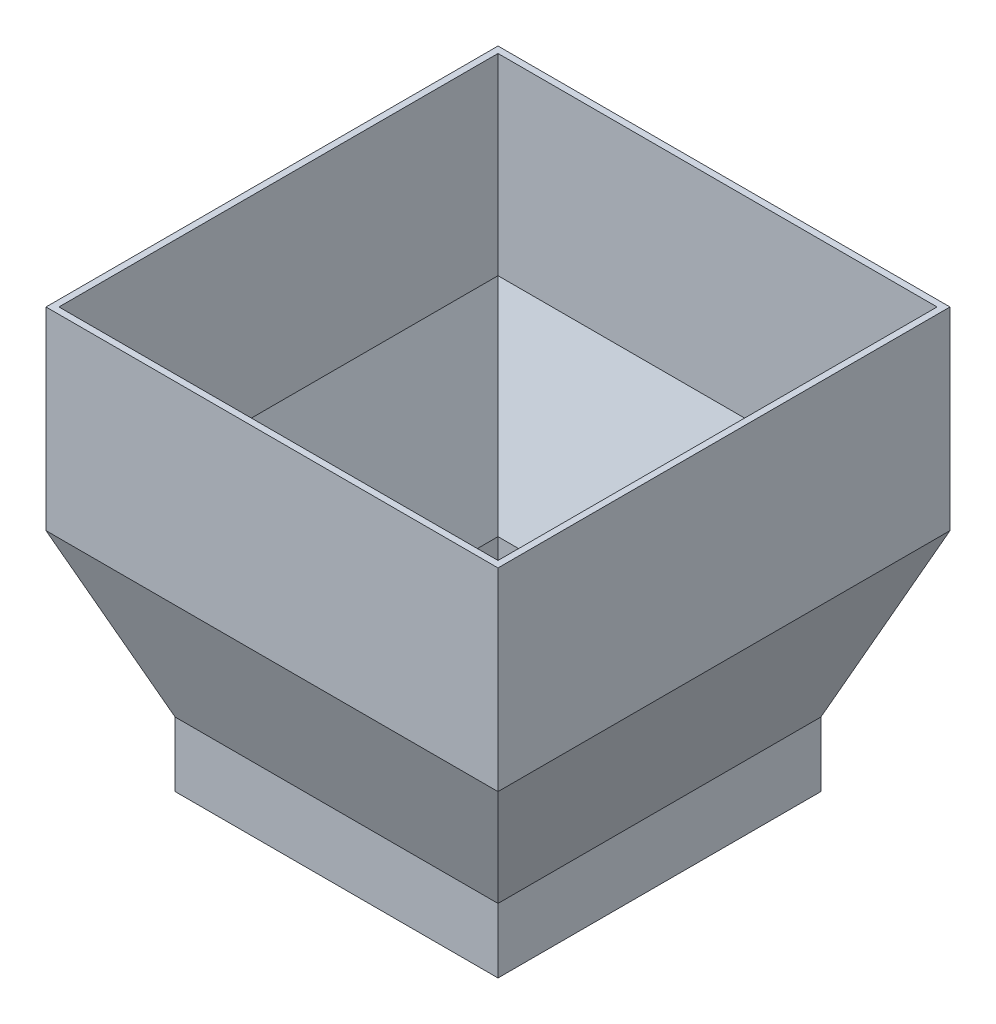
ISO-10303-21;
HEADER;
FILE_DESCRIPTION(('STEP AP214'),'2;1');
FILE_NAME('part.step','',(''),(''),'','','');
FILE_SCHEMA(('AUTOMOTIVE_DESIGN { 1 0 10303 214 1 1 1 1 }'));
ENDSEC;
DATA;
#1=APPLICATION_CONTEXT('core data for automotive mechanical design processes');
#2=APPLICATION_PROTOCOL_DEFINITION('international standard','automotive_design',2000,#1);
#3=PRODUCT_CONTEXT('',#1,'mechanical');
#4=PRODUCT('Part','Part','',(#3));
#5=PRODUCT_RELATED_PRODUCT_CATEGORY('part','',(#4));
#6=PRODUCT_DEFINITION_FORMATION('','',#4);
#7=PRODUCT_DEFINITION_CONTEXT('part definition',#1,'design');
#8=PRODUCT_DEFINITION('design','',#6,#7);
#9=PRODUCT_DEFINITION_SHAPE('','',#8);
#10=(LENGTH_UNIT() NAMED_UNIT(*) SI_UNIT(.MILLI.,.METRE.));
#11=(NAMED_UNIT(*) PLANE_ANGLE_UNIT() SI_UNIT($,.RADIAN.));
#12=(NAMED_UNIT(*) SI_UNIT($,.STERADIAN.) SOLID_ANGLE_UNIT());
#13=UNCERTAINTY_MEASURE_WITH_UNIT(LENGTH_MEASURE(1.E-05),#10,'distance_accuracy_value','');
#14=(GEOMETRIC_REPRESENTATION_CONTEXT(3) GLOBAL_UNCERTAINTY_ASSIGNED_CONTEXT((#13)) GLOBAL_UNIT_ASSIGNED_CONTEXT((#10,
#11,#12)) REPRESENTATION_CONTEXT('',''));
#15=CARTESIAN_POINT('',(0.,0.,0.));
#16=DIRECTION('',(0.,0.,1.));
#17=DIRECTION('',(1.,0.,0.));
#18=AXIS2_PLACEMENT_3D('',#15,#16,#17);
#19=CARTESIAN_POINT('',(350.,300.,-350.));
#20=DIRECTION('',(-1.,0.,0.));
#21=DIRECTION('',(0.,0.,1.));
#22=AXIS2_PLACEMENT_3D('',#19,#20,#21);
#23=PLANE('',#22);
#24=DIRECTION('',(0.,0.,1.));
#25=VECTOR('',#24,1.);
#26=CARTESIAN_POINT('',(350.,0.,-350.));
#27=LINE('',#26,#25);
#28=CARTESIAN_POINT('',(350.,0.,350.));
#29=VERTEX_POINT('',#28);
#30=CARTESIAN_POINT('',(350.,0.,-350.));
#31=VERTEX_POINT('',#30);
#32=EDGE_CURVE('E254',#29,#31,#27,.F.);
#33=ORIENTED_EDGE('',*,*,#32,.T.);
#34=DIRECTION('',(0.,-1.,0.));
#35=VECTOR('',#34,1.);
#36=CARTESIAN_POINT('',(350.,300.,-350.));
#37=LINE('',#36,#35);
#38=CARTESIAN_POINT('',(350.,300.,-350.));
#39=VERTEX_POINT('',#38);
#40=EDGE_CURVE('E12',#39,#31,#37,.T.);
#41=ORIENTED_EDGE('',*,*,#40,.F.);
#42=DIRECTION('',(0.,0.,-1.));
#43=VECTOR('',#42,1.);
#44=CARTESIAN_POINT('',(350.,300.,-350.));
#45=LINE('',#44,#43);
#46=CARTESIAN_POINT('',(350.,300.,350.));
#47=VERTEX_POINT('',#46);
#48=EDGE_CURVE('E434',#47,#39,#45,.T.);
#49=ORIENTED_EDGE('',*,*,#48,.F.);
#50=DIRECTION('',(0.,-1.,0.));
#51=VECTOR('',#50,1.);
#52=CARTESIAN_POINT('',(350.,300.,350.));
#53=LINE('',#52,#51);
#54=EDGE_CURVE('E425',#47,#29,#53,.T.);
#55=ORIENTED_EDGE('',*,*,#54,.T.);
#56=EDGE_LOOP('',(#33,#41,#49,#55));
#57=FACE_BOUND('',#56,.T.);
#58=ADVANCED_FACE('F44',(#57),#23,.F.);
#59=CARTESIAN_POINT('',(-350.,300.,-350.));
#60=DIRECTION('',(0.,0.,1.));
#61=DIRECTION('',(1.,0.,0.));
#62=AXIS2_PLACEMENT_3D('',#59,#60,#61);
#63=PLANE('',#62);
#64=DIRECTION('',(1.,0.,0.));
#65=VECTOR('',#64,1.);
#66=CARTESIAN_POINT('',(-350.,0.,-350.));
#67=LINE('',#66,#65);
#68=CARTESIAN_POINT('',(-350.,0.,-350.));
#69=VERTEX_POINT('',#68);
#70=EDGE_CURVE('E427',#31,#69,#67,.F.);
#71=ORIENTED_EDGE('',*,*,#70,.T.);
#72=DIRECTION('',(0.,-1.,0.));
#73=VECTOR('',#72,1.);
#74=CARTESIAN_POINT('',(-350.,300.,-350.));
#75=LINE('',#74,#73);
#76=CARTESIAN_POINT('',(-350.,300.,-350.));
#77=VERTEX_POINT('',#76);
#78=EDGE_CURVE('E53',#77,#69,#75,.T.);
#79=ORIENTED_EDGE('',*,*,#78,.F.);
#80=DIRECTION('',(-1.,0.,0.));
#81=VECTOR('',#80,1.);
#82=CARTESIAN_POINT('',(-350.,300.,-350.));
#83=LINE('',#82,#81);
#84=EDGE_CURVE('E439',#39,#77,#83,.T.);
#85=ORIENTED_EDGE('',*,*,#84,.F.);
#86=ORIENTED_EDGE('',*,*,#40,.T.);
#87=EDGE_LOOP('',(#71,#79,#85,#86));
#88=FACE_BOUND('',#87,.T.);
#89=ADVANCED_FACE('F413',(#88),#63,.F.);
#90=CARTESIAN_POINT('',(-350.,300.,-350.));
#91=DIRECTION('',(1.,0.,0.));
#92=DIRECTION('',(0.,0.,-1.));
#93=AXIS2_PLACEMENT_3D('',#90,#91,#92);
#94=PLANE('',#93);
#95=DIRECTION('',(0.,0.,-1.));
#96=VECTOR('',#95,1.);
#97=CARTESIAN_POINT('',(-350.,0.,-350.));
#98=LINE('',#97,#96);
#99=CARTESIAN_POINT('',(-350.,0.,350.));
#100=VERTEX_POINT('',#99);
#101=EDGE_CURVE('E398',#69,#100,#98,.F.);
#102=ORIENTED_EDGE('',*,*,#101,.T.);
#103=DIRECTION('',(0.,-1.,0.));
#104=VECTOR('',#103,1.);
#105=CARTESIAN_POINT('',(-350.,300.,350.));
#106=LINE('',#105,#104);
#107=CARTESIAN_POINT('',(-350.,300.,350.));
#108=VERTEX_POINT('',#107);
#109=EDGE_CURVE('E446',#108,#100,#106,.T.);
#110=ORIENTED_EDGE('',*,*,#109,.F.);
#111=DIRECTION('',(0.,0.,1.));
#112=VECTOR('',#111,1.);
#113=CARTESIAN_POINT('',(-350.,300.,-350.));
#114=LINE('',#113,#112);
#115=EDGE_CURVE('E457',#77,#108,#114,.T.);
#116=ORIENTED_EDGE('',*,*,#115,.F.);
#117=ORIENTED_EDGE('',*,*,#78,.T.);
#118=EDGE_LOOP('',(#102,#110,#116,#117));
#119=FACE_BOUND('',#118,.T.);
#120=ADVANCED_FACE('F418',(#119),#94,.F.);
#121=CARTESIAN_POINT('',(-350.,300.,350.));
#122=DIRECTION('',(0.,0.,-1.));
#123=DIRECTION('',(-1.,0.,0.));
#124=AXIS2_PLACEMENT_3D('',#121,#122,#123);
#125=PLANE('',#124);
#126=DIRECTION('',(-1.,0.,0.));
#127=VECTOR('',#126,1.);
#128=CARTESIAN_POINT('',(-350.,0.,350.));
#129=LINE('',#128,#127);
#130=EDGE_CURVE('E432',#100,#29,#129,.F.);
#131=ORIENTED_EDGE('',*,*,#130,.T.);
#132=ORIENTED_EDGE('',*,*,#54,.F.);
#133=DIRECTION('',(1.,0.,0.));
#134=VECTOR('',#133,1.);
#135=CARTESIAN_POINT('',(-350.,300.,350.));
#136=LINE('',#135,#134);
#137=EDGE_CURVE('E452',#108,#47,#136,.T.);
#138=ORIENTED_EDGE('',*,*,#137,.F.);
#139=ORIENTED_EDGE('',*,*,#109,.T.);
#140=EDGE_LOOP('',(#131,#132,#138,#139));
#141=FACE_BOUND('',#140,.T.);
#142=ADVANCED_FACE('F451',(#141),#125,.F.);
#143=CARTESIAN_POINT('',(0.,300.,0.));
#144=DIRECTION('',(0.,1.,0.));
#145=DIRECTION('',(0.,0.,1.));
#146=AXIS2_PLACEMENT_3D('',#143,#144,#145);
#147=PLANE('',#146);
#148=DIRECTION('',(0.,0.,-1.));
#149=VECTOR('',#148,1.);
#150=CARTESIAN_POINT('',(340.,300.,-350.));
#151=LINE('',#150,#149);
#152=CARTESIAN_POINT('',(340.,300.,340.));
#153=VERTEX_POINT('',#152);
#154=CARTESIAN_POINT('',(340.,300.,-340.));
#155=VERTEX_POINT('',#154);
#156=EDGE_CURVE('E188',#153,#155,#151,.T.);
#157=ORIENTED_EDGE('',*,*,#156,.F.);
#158=DIRECTION('',(1.,0.,0.));
#159=VECTOR('',#158,1.);
#160=CARTESIAN_POINT('',(-350.,300.,340.));
#161=LINE('',#160,#159);
#162=CARTESIAN_POINT('',(-340.,300.,340.));
#163=VERTEX_POINT('',#162);
#164=EDGE_CURVE('E193',#163,#153,#161,.T.);
#165=ORIENTED_EDGE('',*,*,#164,.F.);
#166=DIRECTION('',(0.,0.,1.));
#167=VECTOR('',#166,1.);
#168=CARTESIAN_POINT('',(-340.,300.,-350.));
#169=LINE('',#168,#167);
#170=CARTESIAN_POINT('',(-340.,300.,-340.));
#171=VERTEX_POINT('',#170);
#172=EDGE_CURVE('E197',#171,#163,#169,.T.);
#173=ORIENTED_EDGE('',*,*,#172,.F.);
#174=DIRECTION('',(-1.,0.,0.));
#175=VECTOR('',#174,1.);
#176=CARTESIAN_POINT('',(-350.,300.,-340.));
#177=LINE('',#176,#175);
#178=EDGE_CURVE('E231',#155,#171,#177,.T.);
#179=ORIENTED_EDGE('',*,*,#178,.F.);
#180=EDGE_LOOP('',(#157,#165,#173,#179));
#181=FACE_BOUND('',#180,.T.);
#182=ORIENTED_EDGE('',*,*,#48,.T.);
#183=ORIENTED_EDGE('',*,*,#84,.T.);
#184=ORIENTED_EDGE('',*,*,#115,.T.);
#185=ORIENTED_EDGE('',*,*,#137,.T.);
#186=EDGE_LOOP('',(#182,#183,#184,#185));
#187=FACE_BOUND('',#186,.T.);
#188=ADVANCED_FACE('F294',(#181,#187),#147,.T.);
#189=CARTESIAN_POINT('',(0.,-120.689655172414,301.724137931034));
#190=DIRECTION('',(0.,0.371390676354104,-0.928476690885259));
#191=DIRECTION('',(0.,0.928476690885259,0.371390676354104));
#192=AXIS2_PLACEMENT_3D('',#189,#190,#191);
#193=PLANE('',#192);
#194=DIRECTION('',(0.348155311911395,-0.870388279778489,-0.348155311911396));
#195=VECTOR('',#194,1.);
#196=CARTESIAN_POINT('',(-350.,0.,350.));
#197=LINE('',#196,#195);
#198=CARTESIAN_POINT('',(-250.,-250.,250.));
#199=VERTEX_POINT('',#198);
#200=EDGE_CURVE('E264',#100,#199,#197,.T.);
#201=ORIENTED_EDGE('',*,*,#200,.T.);
#202=DIRECTION('',(-1.,0.,0.));
#203=VECTOR('',#202,1.);
#204=CARTESIAN_POINT('',(250.,-250.,250.));
#205=LINE('',#204,#203);
#206=CARTESIAN_POINT('',(250.,-250.,250.));
#207=VERTEX_POINT('',#206);
#208=EDGE_CURVE('E268',#207,#199,#205,.T.);
#209=ORIENTED_EDGE('',*,*,#208,.F.);
#210=DIRECTION('',(-0.348155311911396,-0.870388279778489,-0.348155311911396));
#211=VECTOR('',#210,1.);
#212=CARTESIAN_POINT('',(350.,0.,350.));
#213=LINE('',#212,#211);
#214=EDGE_CURVE('E260',#29,#207,#213,.T.);
#215=ORIENTED_EDGE('',*,*,#214,.F.);
#216=ORIENTED_EDGE('',*,*,#130,.F.);
#217=EDGE_LOOP('',(#201,#209,#215,#216));
#218=FACE_BOUND('',#217,.T.);
#219=ADVANCED_FACE('F283',(#218),#193,.F.);
#220=CARTESIAN_POINT('',(301.724137931034,-120.689655172414,0.));
#221=DIRECTION('',(-0.928476690885259,0.371390676354104,0.));
#222=DIRECTION('',(-0.371390676354104,-0.928476690885259,0.));
#223=AXIS2_PLACEMENT_3D('',#220,#221,#222);
#224=PLANE('',#223);
#225=ORIENTED_EDGE('',*,*,#214,.T.);
#226=DIRECTION('',(0.,0.,1.));
#227=VECTOR('',#226,1.);
#228=CARTESIAN_POINT('',(250.,-250.,250.));
#229=LINE('',#228,#227);
#230=CARTESIAN_POINT('',(250.,-250.,-250.));
#231=VERTEX_POINT('',#230);
#232=EDGE_CURVE('E322',#231,#207,#229,.T.);
#233=ORIENTED_EDGE('',*,*,#232,.F.);
#234=DIRECTION('',(-0.348155311911395,-0.870388279778489,0.348155311911396));
#235=VECTOR('',#234,1.);
#236=CARTESIAN_POINT('',(350.,0.,-350.));
#237=LINE('',#236,#235);
#238=EDGE_CURVE('E251',#31,#231,#237,.T.);
#239=ORIENTED_EDGE('',*,*,#238,.F.);
#240=ORIENTED_EDGE('',*,*,#32,.F.);
#241=EDGE_LOOP('',(#225,#233,#239,#240));
#242=FACE_BOUND('',#241,.T.);
#243=ADVANCED_FACE('F293',(#242),#224,.F.);
#244=CARTESIAN_POINT('',(-301.724137931034,-120.689655172414,0.));
#245=DIRECTION('',(0.928476690885259,0.371390676354104,0.));
#246=DIRECTION('',(-0.371390676354104,0.928476690885259,0.));
#247=AXIS2_PLACEMENT_3D('',#244,#245,#246);
#248=PLANE('',#247);
#249=DIRECTION('',(0.348155311911396,-0.870388279778489,0.348155311911396));
#250=VECTOR('',#249,1.);
#251=CARTESIAN_POINT('',(-350.,0.,-350.));
#252=LINE('',#251,#250);
#253=CARTESIAN_POINT('',(-250.,-250.,-250.));
#254=VERTEX_POINT('',#253);
#255=EDGE_CURVE('E255',#69,#254,#252,.T.);
#256=ORIENTED_EDGE('',*,*,#255,.T.);
#257=DIRECTION('',(0.,0.,-1.));
#258=VECTOR('',#257,1.);
#259=CARTESIAN_POINT('',(-250.,-250.,250.));
#260=LINE('',#259,#258);
#261=EDGE_CURVE('E47',#199,#254,#260,.T.);
#262=ORIENTED_EDGE('',*,*,#261,.F.);
#263=ORIENTED_EDGE('',*,*,#200,.F.);
#264=ORIENTED_EDGE('',*,*,#101,.F.);
#265=EDGE_LOOP('',(#256,#262,#263,#264));
#266=FACE_BOUND('',#265,.T.);
#267=ADVANCED_FACE('F301',(#266),#248,.F.);
#268=CARTESIAN_POINT('',(0.,-120.689655172414,-301.724137931034));
#269=DIRECTION('',(0.,0.371390676354104,0.928476690885259));
#270=DIRECTION('',(0.,-0.928476690885259,0.371390676354104));
#271=AXIS2_PLACEMENT_3D('',#268,#269,#270);
#272=PLANE('',#271);
#273=ORIENTED_EDGE('',*,*,#238,.T.);
#274=DIRECTION('',(1.,0.,0.));
#275=VECTOR('',#274,1.);
#276=CARTESIAN_POINT('',(250.,-250.,-250.));
#277=LINE('',#276,#275);
#278=EDGE_CURVE('E345',#254,#231,#277,.T.);
#279=ORIENTED_EDGE('',*,*,#278,.F.);
#280=ORIENTED_EDGE('',*,*,#255,.F.);
#281=ORIENTED_EDGE('',*,*,#70,.F.);
#282=EDGE_LOOP('',(#273,#279,#280,#281));
#283=FACE_BOUND('',#282,.T.);
#284=ADVANCED_FACE('F463',(#283),#272,.F.);
#285=CARTESIAN_POINT('',(250.,-350.,250.));
#286=DIRECTION('',(-1.,0.,0.));
#287=DIRECTION('',(0.,0.,1.));
#288=AXIS2_PLACEMENT_3D('',#285,#286,#287);
#289=PLANE('',#288);
#290=ORIENTED_EDGE('',*,*,#232,.T.);
#291=DIRECTION('',(0.,1.,0.));
#292=VECTOR('',#291,1.);
#293=CARTESIAN_POINT('',(250.,-350.,250.));
#294=LINE('',#293,#292);
#295=CARTESIAN_POINT('',(250.,-350.,250.));
#296=VERTEX_POINT('',#295);
#297=EDGE_CURVE('E326',#296,#207,#294,.T.);
#298=ORIENTED_EDGE('',*,*,#297,.F.);
#299=DIRECTION('',(0.,0.,1.));
#300=VECTOR('',#299,1.);
#301=CARTESIAN_POINT('',(250.,-350.,250.));
#302=LINE('',#301,#300);
#303=CARTESIAN_POINT('',(250.,-350.,-250.));
#304=VERTEX_POINT('',#303);
#305=EDGE_CURVE('E241',#304,#296,#302,.T.);
#306=ORIENTED_EDGE('',*,*,#305,.F.);
#307=DIRECTION('',(0.,1.,0.));
#308=VECTOR('',#307,1.);
#309=CARTESIAN_POINT('',(250.,-350.,-250.));
#310=LINE('',#309,#308);
#311=EDGE_CURVE('E250',#304,#231,#310,.T.);
#312=ORIENTED_EDGE('',*,*,#311,.T.);
#313=EDGE_LOOP('',(#290,#298,#306,#312));
#314=FACE_BOUND('',#313,.T.);
#315=ADVANCED_FACE('F295',(#314),#289,.F.);
#316=CARTESIAN_POINT('',(-250.,-350.,250.));
#317=DIRECTION('',(0.,0.,-1.));
#318=DIRECTION('',(-1.,0.,0.));
#319=AXIS2_PLACEMENT_3D('',#316,#317,#318);
#320=PLANE('',#319);
#321=ORIENTED_EDGE('',*,*,#208,.T.);
#322=DIRECTION('',(0.,1.,0.));
#323=VECTOR('',#322,1.);
#324=CARTESIAN_POINT('',(-250.,-350.,250.));
#325=LINE('',#324,#323);
#326=CARTESIAN_POINT('',(-250.,-350.,250.));
#327=VERTEX_POINT('',#326);
#328=EDGE_CURVE('E328',#327,#199,#325,.T.);
#329=ORIENTED_EDGE('',*,*,#328,.F.);
#330=DIRECTION('',(-1.,0.,0.));
#331=VECTOR('',#330,1.);
#332=CARTESIAN_POINT('',(-250.,-350.,250.));
#333=LINE('',#332,#331);
#334=EDGE_CURVE('E244',#296,#327,#333,.T.);
#335=ORIENTED_EDGE('',*,*,#334,.F.);
#336=ORIENTED_EDGE('',*,*,#297,.T.);
#337=EDGE_LOOP('',(#321,#329,#335,#336));
#338=FACE_BOUND('',#337,.T.);
#339=ADVANCED_FACE('F376',(#338),#320,.F.);
#340=CARTESIAN_POINT('',(-250.,-350.,250.));
#341=DIRECTION('',(1.,0.,0.));
#342=DIRECTION('',(0.,0.,-1.));
#343=AXIS2_PLACEMENT_3D('',#340,#341,#342);
#344=PLANE('',#343);
#345=ORIENTED_EDGE('',*,*,#261,.T.);
#346=DIRECTION('',(0.,1.,0.));
#347=VECTOR('',#346,1.);
#348=CARTESIAN_POINT('',(-250.,-350.,-250.));
#349=LINE('',#348,#347);
#350=CARTESIAN_POINT('',(-250.,-350.,-250.));
#351=VERTEX_POINT('',#350);
#352=EDGE_CURVE('E347',#351,#254,#349,.T.);
#353=ORIENTED_EDGE('',*,*,#352,.F.);
#354=DIRECTION('',(0.,0.,-1.));
#355=VECTOR('',#354,1.);
#356=CARTESIAN_POINT('',(-250.,-350.,250.));
#357=LINE('',#356,#355);
#358=EDGE_CURVE('E246',#327,#351,#357,.T.);
#359=ORIENTED_EDGE('',*,*,#358,.F.);
#360=ORIENTED_EDGE('',*,*,#328,.T.);
#361=EDGE_LOOP('',(#345,#353,#359,#360));
#362=FACE_BOUND('',#361,.T.);
#363=ADVANCED_FACE('F372',(#362),#344,.F.);
#364=CARTESIAN_POINT('',(-250.,-350.,-250.));
#365=DIRECTION('',(0.,0.,1.));
#366=DIRECTION('',(1.,0.,0.));
#367=AXIS2_PLACEMENT_3D('',#364,#365,#366);
#368=PLANE('',#367);
#369=ORIENTED_EDGE('',*,*,#278,.T.);
#370=ORIENTED_EDGE('',*,*,#311,.F.);
#371=DIRECTION('',(1.,0.,0.));
#372=VECTOR('',#371,1.);
#373=CARTESIAN_POINT('',(-250.,-350.,-250.));
#374=LINE('',#373,#372);
#375=EDGE_CURVE('E248',#351,#304,#374,.T.);
#376=ORIENTED_EDGE('',*,*,#375,.F.);
#377=ORIENTED_EDGE('',*,*,#352,.T.);
#378=EDGE_LOOP('',(#369,#370,#376,#377));
#379=FACE_BOUND('',#378,.T.);
#380=ADVANCED_FACE('F361',(#379),#368,.F.);
#381=CARTESIAN_POINT('',(0.,-350.,0.));
#382=DIRECTION('',(0.,-1.,0.));
#383=DIRECTION('',(0.,0.,-1.));
#384=AXIS2_PLACEMENT_3D('',#381,#382,#383);
#385=PLANE('',#384);
#386=DIRECTION('',(0.,0.,1.));
#387=VECTOR('',#386,1.);
#388=CARTESIAN_POINT('',(240.,-350.,250.));
#389=LINE('',#388,#387);
#390=CARTESIAN_POINT('',(240.,-350.,-240.));
#391=VERTEX_POINT('',#390);
#392=CARTESIAN_POINT('',(240.,-350.,240.));
#393=VERTEX_POINT('',#392);
#394=EDGE_CURVE('E237',#391,#393,#389,.T.);
#395=ORIENTED_EDGE('',*,*,#394,.F.);
#396=DIRECTION('',(1.,0.,0.));
#397=VECTOR('',#396,1.);
#398=CARTESIAN_POINT('',(-250.,-350.,-240.));
#399=LINE('',#398,#397);
#400=CARTESIAN_POINT('',(-240.,-350.,-240.));
#401=VERTEX_POINT('',#400);
#402=EDGE_CURVE('E228',#401,#391,#399,.T.);
#403=ORIENTED_EDGE('',*,*,#402,.F.);
#404=DIRECTION('',(0.,0.,-1.));
#405=VECTOR('',#404,1.);
#406=CARTESIAN_POINT('',(-240.,-350.,250.));
#407=LINE('',#406,#405);
#408=CARTESIAN_POINT('',(-240.,-350.,240.));
#409=VERTEX_POINT('',#408);
#410=EDGE_CURVE('E236',#409,#401,#407,.T.);
#411=ORIENTED_EDGE('',*,*,#410,.F.);
#412=DIRECTION('',(-1.,0.,0.));
#413=VECTOR('',#412,1.);
#414=CARTESIAN_POINT('',(-250.,-350.,240.));
#415=LINE('',#414,#413);
#416=EDGE_CURVE('E234',#393,#409,#415,.T.);
#417=ORIENTED_EDGE('',*,*,#416,.F.);
#418=EDGE_LOOP('',(#395,#403,#411,#417));
#419=FACE_BOUND('',#418,.T.);
#420=ORIENTED_EDGE('',*,*,#305,.T.);
#421=ORIENTED_EDGE('',*,*,#334,.T.);
#422=ORIENTED_EDGE('',*,*,#358,.T.);
#423=ORIENTED_EDGE('',*,*,#375,.T.);
#424=EDGE_LOOP('',(#420,#421,#422,#423));
#425=FACE_BOUND('',#424,.T.);
#426=ADVANCED_FACE('F371',(#419,#425),#385,.T.);
#427=CARTESIAN_POINT('',(340.,300.,-350.));
#428=DIRECTION('',(-1.,0.,0.));
#429=DIRECTION('',(0.,0.,1.));
#430=AXIS2_PLACEMENT_3D('',#427,#428,#429);
#431=PLANE('',#430);
#432=DIRECTION('',(0.,0.,-1.));
#433=VECTOR('',#432,1.);
#434=CARTESIAN_POINT('',(340.,1.92582403567215,-350.));
#435=LINE('',#434,#433);
#436=CARTESIAN_POINT('',(340.,1.92582403567265,340.));
#437=VERTEX_POINT('',#436);
#438=CARTESIAN_POINT('',(340.,1.92582403567244,-340.));
#439=VERTEX_POINT('',#438);
#440=EDGE_CURVE('E161',#437,#439,#435,.T.);
#441=ORIENTED_EDGE('',*,*,#440,.F.);
#442=DIRECTION('',(0.,-1.,0.));
#443=VECTOR('',#442,1.);
#444=CARTESIAN_POINT('',(340.,300.,340.));
#445=LINE('',#444,#443);
#446=EDGE_CURVE('E165',#153,#437,#445,.T.);
#447=ORIENTED_EDGE('',*,*,#446,.F.);
#448=ORIENTED_EDGE('',*,*,#156,.T.);
#449=DIRECTION('',(0.,-1.,0.));
#450=VECTOR('',#449,1.);
#451=CARTESIAN_POINT('',(340.,300.,-340.));
#452=LINE('',#451,#450);
#453=EDGE_CURVE('E168',#155,#439,#452,.T.);
#454=ORIENTED_EDGE('',*,*,#453,.T.);
#455=EDGE_LOOP('',(#441,#447,#448,#454));
#456=FACE_BOUND('',#455,.T.);
#457=ADVANCED_FACE('F163',(#456),#431,.T.);
#458=CARTESIAN_POINT('',(-350.,300.,-340.));
#459=DIRECTION('',(0.,0.,1.));
#460=DIRECTION('',(1.,0.,0.));
#461=AXIS2_PLACEMENT_3D('',#458,#459,#460);
#462=PLANE('',#461);
#463=DIRECTION('',(-1.,0.,0.));
#464=VECTOR('',#463,1.);
#465=CARTESIAN_POINT('',(-350.,1.92582403567287,-340.));
#466=LINE('',#465,#464);
#467=CARTESIAN_POINT('',(-340.,1.92582403567275,-340.));
#468=VERTEX_POINT('',#467);
#469=EDGE_CURVE('E171',#439,#468,#466,.T.);
#470=ORIENTED_EDGE('',*,*,#469,.F.);
#471=ORIENTED_EDGE('',*,*,#453,.F.);
#472=ORIENTED_EDGE('',*,*,#178,.T.);
#473=DIRECTION('',(0.,-1.,0.));
#474=VECTOR('',#473,1.);
#475=CARTESIAN_POINT('',(-340.,300.,-340.));
#476=LINE('',#475,#474);
#477=EDGE_CURVE('E195',#171,#468,#476,.T.);
#478=ORIENTED_EDGE('',*,*,#477,.T.);
#479=EDGE_LOOP('',(#470,#471,#472,#478));
#480=FACE_BOUND('',#479,.T.);
#481=ADVANCED_FACE('F409',(#480),#462,.T.);
#482=CARTESIAN_POINT('',(-340.,300.,-350.));
#483=DIRECTION('',(1.,0.,0.));
#484=DIRECTION('',(0.,0.,-1.));
#485=AXIS2_PLACEMENT_3D('',#482,#483,#484);
#486=PLANE('',#485);
#487=DIRECTION('',(0.,0.,1.));
#488=VECTOR('',#487,1.);
#489=CARTESIAN_POINT('',(-340.,1.92582403567265,-350.));
#490=LINE('',#489,#488);
#491=CARTESIAN_POINT('',(-340.,1.92582403567256,340.));
#492=VERTEX_POINT('',#491);
#493=EDGE_CURVE('E189',#468,#492,#490,.T.);
#494=ORIENTED_EDGE('',*,*,#493,.F.);
#495=ORIENTED_EDGE('',*,*,#477,.F.);
#496=ORIENTED_EDGE('',*,*,#172,.T.);
#497=DIRECTION('',(0.,-1.,0.));
#498=VECTOR('',#497,1.);
#499=CARTESIAN_POINT('',(-340.,300.,340.));
#500=LINE('',#499,#498);
#501=EDGE_CURVE('E61',#163,#492,#500,.T.);
#502=ORIENTED_EDGE('',*,*,#501,.T.);
#503=EDGE_LOOP('',(#494,#495,#496,#502));
#504=FACE_BOUND('',#503,.T.);
#505=ADVANCED_FACE('F566',(#504),#486,.T.);
#506=CARTESIAN_POINT('',(-350.,300.,340.));
#507=DIRECTION('',(0.,0.,-1.));
#508=DIRECTION('',(-1.,0.,0.));
#509=AXIS2_PLACEMENT_3D('',#506,#507,#508);
#510=PLANE('',#509);
#511=DIRECTION('',(1.,0.,0.));
#512=VECTOR('',#511,1.);
#513=CARTESIAN_POINT('',(-350.,1.92582403567287,340.));
#514=LINE('',#513,#512);
#515=EDGE_CURVE('E185',#492,#437,#514,.T.);
#516=ORIENTED_EDGE('',*,*,#515,.F.);
#517=ORIENTED_EDGE('',*,*,#501,.F.);
#518=ORIENTED_EDGE('',*,*,#164,.T.);
#519=ORIENTED_EDGE('',*,*,#446,.T.);
#520=EDGE_LOOP('',(#516,#517,#518,#519));
#521=FACE_BOUND('',#520,.T.);
#522=ADVANCED_FACE('F191',(#521),#510,.T.);
#523=CARTESIAN_POINT('',(0.,-116.975748408873,292.439371022182));
#524=DIRECTION('',(0.,0.371390676354104,-0.928476690885259));
#525=DIRECTION('',(0.,0.928476690885259,0.371390676354104));
#526=AXIS2_PLACEMENT_3D('',#523,#524,#525);
#527=PLANE('',#526);
#528=DIRECTION('',(0.348155311911396,-0.870388279778489,-0.348155311911396));
#529=VECTOR('',#528,1.);
#530=CARTESIAN_POINT('',(-256.992174534645,-205.593739627716,256.992174534645));
#531=LINE('',#530,#529);
#532=CARTESIAN_POINT('',(-240.,-248.074175964327,240.));
#533=VERTEX_POINT('',#532);
#534=EDGE_CURVE('E183',#492,#533,#531,.T.);
#535=ORIENTED_EDGE('',*,*,#534,.F.);
#536=ORIENTED_EDGE('',*,*,#515,.T.);
#537=DIRECTION('',(-0.348155311911396,-0.870388279778489,-0.348155311911396));
#538=VECTOR('',#537,1.);
#539=CARTESIAN_POINT('',(256.992174534645,-205.593739627716,256.992174534645));
#540=LINE('',#539,#538);
#541=CARTESIAN_POINT('',(240.,-248.074175964327,240.));
#542=VERTEX_POINT('',#541);
#543=EDGE_CURVE('E175',#437,#542,#540,.T.);
#544=ORIENTED_EDGE('',*,*,#543,.T.);
#545=DIRECTION('',(-1.,0.,0.));
#546=VECTOR('',#545,1.);
#547=CARTESIAN_POINT('',(0.,-248.074175964327,240.));
#548=LINE('',#547,#546);
#549=EDGE_CURVE('E207',#542,#533,#548,.T.);
#550=ORIENTED_EDGE('',*,*,#549,.T.);
#551=EDGE_LOOP('',(#535,#536,#544,#550));
#552=FACE_BOUND('',#551,.T.);
#553=ADVANCED_FACE('F186',(#552),#527,.T.);
#554=CARTESIAN_POINT('',(292.439371022182,-116.975748408873,0.));
#555=DIRECTION('',(-0.928476690885259,0.371390676354104,0.));
#556=DIRECTION('',(-0.371390676354104,-0.928476690885259,0.));
#557=AXIS2_PLACEMENT_3D('',#554,#555,#556);
#558=PLANE('',#557);
#559=ORIENTED_EDGE('',*,*,#543,.F.);
#560=ORIENTED_EDGE('',*,*,#440,.T.);
#561=DIRECTION('',(-0.348155311911396,-0.870388279778489,0.348155311911396));
#562=VECTOR('',#561,1.);
#563=CARTESIAN_POINT('',(256.992174534645,-205.593739627716,-256.992174534645));
#564=LINE('',#563,#562);
#565=CARTESIAN_POINT('',(240.,-248.074175964327,-240.));
#566=VERTEX_POINT('',#565);
#567=EDGE_CURVE('E172',#439,#566,#564,.T.);
#568=ORIENTED_EDGE('',*,*,#567,.T.);
#569=DIRECTION('',(0.,0.,1.));
#570=VECTOR('',#569,1.);
#571=CARTESIAN_POINT('',(240.,-248.074175964328,0.));
#572=LINE('',#571,#570);
#573=EDGE_CURVE('E178',#566,#542,#572,.T.);
#574=ORIENTED_EDGE('',*,*,#573,.T.);
#575=EDGE_LOOP('',(#559,#560,#568,#574));
#576=FACE_BOUND('',#575,.T.);
#577=ADVANCED_FACE('F177',(#576),#558,.T.);
#578=CARTESIAN_POINT('',(-292.439371022182,-116.975748408873,0.));
#579=DIRECTION('',(0.928476690885259,0.371390676354104,0.));
#580=DIRECTION('',(-0.371390676354104,0.928476690885259,0.));
#581=AXIS2_PLACEMENT_3D('',#578,#579,#580);
#582=PLANE('',#581);
#583=DIRECTION('',(0.348155311911396,-0.870388279778489,0.348155311911396));
#584=VECTOR('',#583,1.);
#585=CARTESIAN_POINT('',(-256.992174534645,-205.593739627716,-256.992174534645));
#586=LINE('',#585,#584);
#587=CARTESIAN_POINT('',(-240.,-248.074175964327,-240.));
#588=VERTEX_POINT('',#587);
#589=EDGE_CURVE('E182',#468,#588,#586,.T.);
#590=ORIENTED_EDGE('',*,*,#589,.F.);
#591=ORIENTED_EDGE('',*,*,#493,.T.);
#592=ORIENTED_EDGE('',*,*,#534,.T.);
#593=DIRECTION('',(0.,0.,-1.));
#594=VECTOR('',#593,1.);
#595=CARTESIAN_POINT('',(-240.,-248.074175964327,0.));
#596=LINE('',#595,#594);
#597=EDGE_CURVE('E214',#533,#588,#596,.T.);
#598=ORIENTED_EDGE('',*,*,#597,.T.);
#599=EDGE_LOOP('',(#590,#591,#592,#598));
#600=FACE_BOUND('',#599,.T.);
#601=ADVANCED_FACE('F597',(#600),#582,.T.);
#602=CARTESIAN_POINT('',(0.,-116.975748408873,-292.439371022182));
#603=DIRECTION('',(0.,0.371390676354104,0.928476690885259));
#604=DIRECTION('',(0.,-0.928476690885259,0.371390676354104));
#605=AXIS2_PLACEMENT_3D('',#602,#603,#604);
#606=PLANE('',#605);
#607=ORIENTED_EDGE('',*,*,#567,.F.);
#608=ORIENTED_EDGE('',*,*,#469,.T.);
#609=ORIENTED_EDGE('',*,*,#589,.T.);
#610=DIRECTION('',(1.,0.,0.));
#611=VECTOR('',#610,1.);
#612=CARTESIAN_POINT('',(0.,-248.074175964327,-240.));
#613=LINE('',#612,#611);
#614=EDGE_CURVE('E210',#588,#566,#613,.T.);
#615=ORIENTED_EDGE('',*,*,#614,.T.);
#616=EDGE_LOOP('',(#607,#608,#609,#615));
#617=FACE_BOUND('',#616,.T.);
#618=ADVANCED_FACE('F605',(#617),#606,.T.);
#619=CARTESIAN_POINT('',(240.,-350.,250.));
#620=DIRECTION('',(-1.,0.,0.));
#621=DIRECTION('',(0.,0.,1.));
#622=AXIS2_PLACEMENT_3D('',#619,#620,#621);
#623=PLANE('',#622);
#624=ORIENTED_EDGE('',*,*,#573,.F.);
#625=DIRECTION('',(0.,1.,0.));
#626=VECTOR('',#625,1.);
#627=CARTESIAN_POINT('',(240.,-350.,-240.));
#628=LINE('',#627,#626);
#629=EDGE_CURVE('E225',#391,#566,#628,.T.);
#630=ORIENTED_EDGE('',*,*,#629,.F.);
#631=ORIENTED_EDGE('',*,*,#394,.T.);
#632=DIRECTION('',(0.,1.,0.));
#633=VECTOR('',#632,1.);
#634=CARTESIAN_POINT('',(240.,-350.,240.));
#635=LINE('',#634,#633);
#636=EDGE_CURVE('E219',#393,#542,#635,.T.);
#637=ORIENTED_EDGE('',*,*,#636,.T.);
#638=EDGE_LOOP('',(#624,#630,#631,#637));
#639=FACE_BOUND('',#638,.T.);
#640=ADVANCED_FACE('F614',(#639),#623,.T.);
#641=CARTESIAN_POINT('',(-250.,-350.,240.));
#642=DIRECTION('',(0.,0.,-1.));
#643=DIRECTION('',(-1.,0.,0.));
#644=AXIS2_PLACEMENT_3D('',#641,#642,#643);
#645=PLANE('',#644);
#646=ORIENTED_EDGE('',*,*,#549,.F.);
#647=ORIENTED_EDGE('',*,*,#636,.F.);
#648=ORIENTED_EDGE('',*,*,#416,.T.);
#649=DIRECTION('',(0.,1.,0.));
#650=VECTOR('',#649,1.);
#651=CARTESIAN_POINT('',(-240.,-350.,240.));
#652=LINE('',#651,#650);
#653=EDGE_CURVE('E220',#409,#533,#652,.T.);
#654=ORIENTED_EDGE('',*,*,#653,.T.);
#655=EDGE_LOOP('',(#646,#647,#648,#654));
#656=FACE_BOUND('',#655,.T.);
#657=ADVANCED_FACE('F623',(#656),#645,.T.);
#658=CARTESIAN_POINT('',(-240.,-350.,250.));
#659=DIRECTION('',(1.,0.,0.));
#660=DIRECTION('',(0.,0.,-1.));
#661=AXIS2_PLACEMENT_3D('',#658,#659,#660);
#662=PLANE('',#661);
#663=ORIENTED_EDGE('',*,*,#597,.F.);
#664=ORIENTED_EDGE('',*,*,#653,.F.);
#665=ORIENTED_EDGE('',*,*,#410,.T.);
#666=DIRECTION('',(0.,1.,0.));
#667=VECTOR('',#666,1.);
#668=CARTESIAN_POINT('',(-240.,-350.,-240.));
#669=LINE('',#668,#667);
#670=EDGE_CURVE('E69',#401,#588,#669,.T.);
#671=ORIENTED_EDGE('',*,*,#670,.T.);
#672=EDGE_LOOP('',(#663,#664,#665,#671));
#673=FACE_BOUND('',#672,.T.);
#674=ADVANCED_FACE('F632',(#673),#662,.T.);
#675=CARTESIAN_POINT('',(-250.,-350.,-240.));
#676=DIRECTION('',(0.,0.,1.));
#677=DIRECTION('',(1.,0.,0.));
#678=AXIS2_PLACEMENT_3D('',#675,#676,#677);
#679=PLANE('',#678);
#680=ORIENTED_EDGE('',*,*,#614,.F.);
#681=ORIENTED_EDGE('',*,*,#670,.F.);
#682=ORIENTED_EDGE('',*,*,#402,.T.);
#683=ORIENTED_EDGE('',*,*,#629,.T.);
#684=EDGE_LOOP('',(#680,#681,#682,#683));
#685=FACE_BOUND('',#684,.T.);
#686=ADVANCED_FACE('F641',(#685),#679,.T.);
#687=CLOSED_SHELL('',(#58,#89,#120,#142,#188,#219,#243,#267,#284,#315,#339,#363,#380,#426,#457,
#481,#505,#522,#553,#577,#601,#618,#640,#657,#674,#686));
#688=MANIFOLD_SOLID_BREP('B2',#687);
#689=ADVANCED_BREP_SHAPE_REPRESENTATION('',(#18,#688),#14);
#690=SHAPE_DEFINITION_REPRESENTATION(#9,#689);
ENDSEC;
END-ISO-10303-21;
